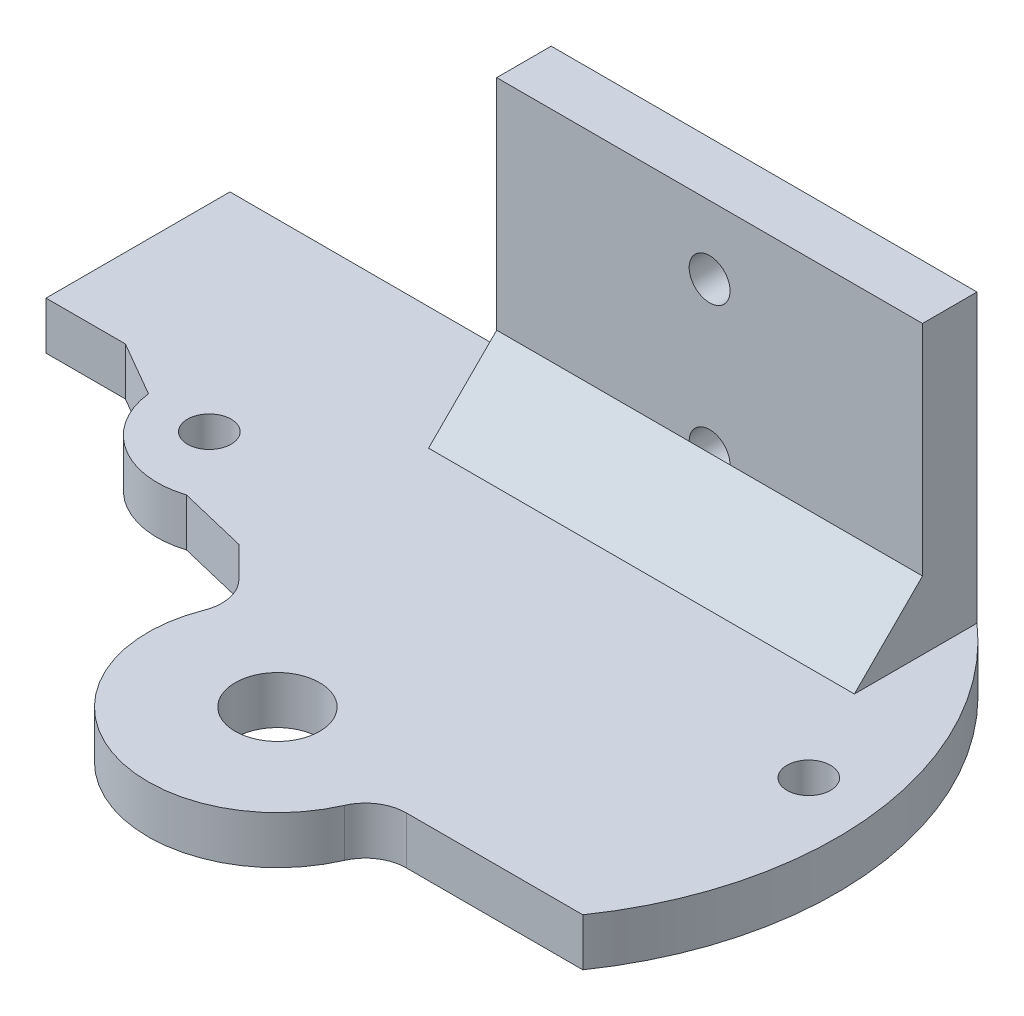
ISO-10303-21;
HEADER;
FILE_DESCRIPTION(('STEP AP214'),'2;1');
FILE_NAME('part.step','',(''),(''),'','','');
FILE_SCHEMA(('AUTOMOTIVE_DESIGN { 1 0 10303 214 1 1 1 1 }'));
ENDSEC;
DATA;
#1=APPLICATION_CONTEXT('core data for automotive mechanical design processes');
#2=APPLICATION_PROTOCOL_DEFINITION('international standard','automotive_design',2000,#1);
#3=PRODUCT_CONTEXT('',#1,'mechanical');
#4=PRODUCT('Part','Part','',(#3));
#5=PRODUCT_RELATED_PRODUCT_CATEGORY('part','',(#4));
#6=PRODUCT_DEFINITION_FORMATION('','',#4);
#7=PRODUCT_DEFINITION_CONTEXT('part definition',#1,'design');
#8=PRODUCT_DEFINITION('design','',#6,#7);
#9=PRODUCT_DEFINITION_SHAPE('','',#8);
#10=(LENGTH_UNIT() NAMED_UNIT(*) SI_UNIT(.MILLI.,.METRE.));
#11=(NAMED_UNIT(*) PLANE_ANGLE_UNIT() SI_UNIT($,.RADIAN.));
#12=(NAMED_UNIT(*) SI_UNIT($,.STERADIAN.) SOLID_ANGLE_UNIT());
#13=UNCERTAINTY_MEASURE_WITH_UNIT(LENGTH_MEASURE(1.E-05),#10,'distance_accuracy_value','');
#14=(GEOMETRIC_REPRESENTATION_CONTEXT(3) GLOBAL_UNCERTAINTY_ASSIGNED_CONTEXT((#13)) GLOBAL_UNIT_ASSIGNED_CONTEXT((#10,
#11,#12)) REPRESENTATION_CONTEXT('',''));
#15=CARTESIAN_POINT('',(0.,0.,0.));
#16=DIRECTION('',(0.,0.,1.));
#17=DIRECTION('',(1.,0.,0.));
#18=AXIS2_PLACEMENT_3D('',#15,#16,#17);
#19=CARTESIAN_POINT('',(20.3496,17.,-13.5));
#20=DIRECTION('',(0.,0.,1.));
#21=DIRECTION('',(1.,0.,0.));
#22=AXIS2_PLACEMENT_3D('',#19,#20,#21);
#23=PLANE('',#22);
#24=CARTESIAN_POINT('',(4.72198433686638,22.,-13.5));
#25=DIRECTION('',(0.,0.,1.));
#26=DIRECTION('',(1.,0.,0.));
#27=AXIS2_PLACEMENT_3D('',#24,#25,#26);
#28=CIRCLE('',#27,1.5);
#29=CARTESIAN_POINT('',(6.22198433686639,22.,-13.5));
#30=VERTEX_POINT('',#29);
#31=EDGE_CURVE('E336',#30,#30,#28,.T.);
#32=ORIENTED_EDGE('',*,*,#31,.T.);
#33=EDGE_LOOP('',(#32));
#34=FACE_BOUND('',#33,.T.);
#35=CARTESIAN_POINT('',(4.72198433686638,33.0559630595284,-13.5));
#36=DIRECTION('',(0.,0.,1.));
#37=DIRECTION('',(1.,0.,0.));
#38=AXIS2_PLACEMENT_3D('',#35,#36,#37);
#39=CIRCLE('',#38,1.5);
#40=CARTESIAN_POINT('',(6.22198433686638,33.0559630595284,-13.5));
#41=VERTEX_POINT('',#40);
#42=EDGE_CURVE('E342',#41,#41,#39,.T.);
#43=ORIENTED_EDGE('',*,*,#42,.T.);
#44=EDGE_LOOP('',(#43));
#45=FACE_BOUND('',#44,.T.);
#46=DIRECTION('',(1.,0.,0.));
#47=VECTOR('',#46,1.);
#48=CARTESIAN_POINT('',(20.3496,17.,-13.5));
#49=LINE('',#48,#47);
#50=CARTESIAN_POINT('',(-34.4868,17.,-13.5));
#51=VERTEX_POINT('',#50);
#52=CARTESIAN_POINT('',(-10.9056313262672,17.,-13.5));
#53=VERTEX_POINT('',#52);
#54=EDGE_CURVE('E347',#51,#53,#49,.T.);
#55=ORIENTED_EDGE('',*,*,#54,.T.);
#56=DIRECTION('',(0.,1.,0.));
#57=VECTOR('',#56,1.);
#58=CARTESIAN_POINT('',(-10.9056313262672,17.,-13.5));
#59=LINE('',#58,#57);
#60=CARTESIAN_POINT('',(-10.9056313262672,38.0559630595284,-13.5));
#61=VERTEX_POINT('',#60);
#62=EDGE_CURVE('E315',#53,#61,#59,.T.);
#63=ORIENTED_EDGE('',*,*,#62,.T.);
#64=DIRECTION('',(1.,0.,0.));
#65=VECTOR('',#64,1.);
#66=CARTESIAN_POINT('',(-34.4868,38.0559630595284,-13.5));
#67=LINE('',#66,#65);
#68=CARTESIAN_POINT('',(20.3496,38.0559630595284,-13.5));
#69=VERTEX_POINT('',#68);
#70=EDGE_CURVE('E283',#61,#69,#67,.T.);
#71=ORIENTED_EDGE('',*,*,#70,.T.);
#72=DIRECTION('',(0.,-1.,0.));
#73=VECTOR('',#72,1.);
#74=CARTESIAN_POINT('',(20.3496,38.0559630595284,-13.5));
#75=LINE('',#74,#73);
#76=CARTESIAN_POINT('',(20.3496,17.,-13.5));
#77=VERTEX_POINT('',#76);
#78=EDGE_CURVE('E354',#69,#77,#75,.T.);
#79=ORIENTED_EDGE('',*,*,#78,.T.);
#80=DIRECTION('',(0.,-1.,0.));
#81=VECTOR('',#80,1.);
#82=CARTESIAN_POINT('',(20.3496,17.,-13.5));
#83=LINE('',#82,#81);
#84=CARTESIAN_POINT('',(20.3496,13.5,-13.5));
#85=VERTEX_POINT('',#84);
#86=EDGE_CURVE('E169',#77,#85,#83,.T.);
#87=ORIENTED_EDGE('',*,*,#86,.T.);
#88=DIRECTION('',(-1.,0.,0.));
#89=VECTOR('',#88,1.);
#90=CARTESIAN_POINT('',(20.3496,13.5,-13.5));
#91=LINE('',#90,#89);
#92=CARTESIAN_POINT('',(-34.4868,13.5,-13.5));
#93=VERTEX_POINT('',#92);
#94=EDGE_CURVE('E170',#85,#93,#91,.T.);
#95=ORIENTED_EDGE('',*,*,#94,.T.);
#96=DIRECTION('',(0.,-1.,0.));
#97=VECTOR('',#96,1.);
#98=CARTESIAN_POINT('',(-34.4868,17.,-13.5));
#99=LINE('',#98,#97);
#100=EDGE_CURVE('E12',#51,#93,#99,.T.);
#101=ORIENTED_EDGE('',*,*,#100,.F.);
#102=EDGE_LOOP('',(#55,#63,#71,#79,#87,#95,#101));
#103=FACE_BOUND('',#102,.T.);
#104=ADVANCED_FACE('F36',(#34,#45,#103),#23,.F.);
#105=CARTESIAN_POINT('',(-34.4868,17.,-13.5));
#106=DIRECTION('',(1.,0.,0.));
#107=DIRECTION('',(0.,0.,-1.));
#108=AXIS2_PLACEMENT_3D('',#105,#106,#107);
#109=PLANE('',#108);
#110=DIRECTION('',(0.,0.,1.));
#111=VECTOR('',#110,1.);
#112=CARTESIAN_POINT('',(-34.4868,17.,-13.5));
#113=LINE('',#112,#111);
#114=CARTESIAN_POINT('',(-34.4868,17.,0.));
#115=VERTEX_POINT('',#114);
#116=EDGE_CURVE('E39',#51,#115,#113,.T.);
#117=ORIENTED_EDGE('',*,*,#116,.F.);
#118=ORIENTED_EDGE('',*,*,#100,.T.);
#119=DIRECTION('',(0.,0.,1.));
#120=VECTOR('',#119,1.);
#121=CARTESIAN_POINT('',(-34.4868,13.5,-13.5));
#122=LINE('',#121,#120);
#123=CARTESIAN_POINT('',(-34.4868,13.5,0.));
#124=VERTEX_POINT('',#123);
#125=EDGE_CURVE('E173',#93,#124,#122,.T.);
#126=ORIENTED_EDGE('',*,*,#125,.T.);
#127=DIRECTION('',(0.,-1.,0.));
#128=VECTOR('',#127,1.);
#129=CARTESIAN_POINT('',(-34.4868,17.,0.));
#130=LINE('',#129,#128);
#131=EDGE_CURVE('E45',#115,#124,#130,.T.);
#132=ORIENTED_EDGE('',*,*,#131,.F.);
#133=EDGE_LOOP('',(#117,#118,#126,#132));
#134=FACE_BOUND('',#133,.T.);
#135=ADVANCED_FACE('F383',(#134),#109,.F.);
#136=CARTESIAN_POINT('',(-34.4868,17.,0.));
#137=DIRECTION('',(0.,0.,-1.));
#138=DIRECTION('',(-1.,0.,0.));
#139=AXIS2_PLACEMENT_3D('',#136,#137,#138);
#140=PLANE('',#139);
#141=DIRECTION('',(1.,0.,0.));
#142=VECTOR('',#141,1.);
#143=CARTESIAN_POINT('',(-34.4868,13.5,0.));
#144=LINE('',#143,#142);
#145=CARTESIAN_POINT('',(-28.6613749786786,13.5,0.));
#146=VERTEX_POINT('',#145);
#147=EDGE_CURVE('E176',#124,#146,#144,.T.);
#148=ORIENTED_EDGE('',*,*,#147,.T.);
#149=DIRECTION('',(0.,-1.,0.));
#150=VECTOR('',#149,1.);
#151=CARTESIAN_POINT('',(-28.6613749786786,17.,0.));
#152=LINE('',#151,#150);
#153=CARTESIAN_POINT('',(-28.6613749786786,17.,0.));
#154=VERTEX_POINT('',#153);
#155=EDGE_CURVE('E211',#154,#146,#152,.T.);
#156=ORIENTED_EDGE('',*,*,#155,.F.);
#157=DIRECTION('',(1.,0.,0.));
#158=VECTOR('',#157,1.);
#159=CARTESIAN_POINT('',(-34.4868,17.,0.));
#160=LINE('',#159,#158);
#161=EDGE_CURVE('E242',#115,#154,#160,.T.);
#162=ORIENTED_EDGE('',*,*,#161,.F.);
#163=ORIENTED_EDGE('',*,*,#131,.T.);
#164=EDGE_LOOP('',(#148,#156,#162,#163));
#165=FACE_BOUND('',#164,.T.);
#166=ADVANCED_FACE('F388',(#165),#140,.F.);
#167=CARTESIAN_POINT('',(-28.6613749786786,17.,0.));
#168=DIRECTION('',(0.500442701800588,0.,-0.865769658866911));
#169=DIRECTION('',(-0.865769658866911,0.,-0.500442701800588));
#170=AXIS2_PLACEMENT_3D('',#167,#168,#169);
#171=PLANE('',#170);
#172=DIRECTION('',(0.865769658866911,0.,0.500442701800588));
#173=VECTOR('',#172,1.);
#174=CARTESIAN_POINT('',(-28.6613749786786,13.5,0.));
#175=LINE('',#174,#173);
#176=CARTESIAN_POINT('',(-24.6424002082218,13.5,2.32309664816397));
#177=VERTEX_POINT('',#176);
#178=EDGE_CURVE('E178',#146,#177,#175,.T.);
#179=ORIENTED_EDGE('',*,*,#178,.T.);
#180=DIRECTION('',(0.,-1.,0.));
#181=VECTOR('',#180,1.);
#182=CARTESIAN_POINT('',(-24.6424002082218,17.,2.32309664816397));
#183=LINE('',#182,#181);
#184=CARTESIAN_POINT('',(-24.6424002082218,17.,2.32309664816397));
#185=VERTEX_POINT('',#184);
#186=EDGE_CURVE('E208',#185,#177,#183,.T.);
#187=ORIENTED_EDGE('',*,*,#186,.F.);
#188=DIRECTION('',(0.865769658866911,0.,0.500442701800588));
#189=VECTOR('',#188,1.);
#190=CARTESIAN_POINT('',(-28.6613749786786,17.,0.));
#191=LINE('',#190,#189);
#192=EDGE_CURVE('E244',#154,#185,#191,.T.);
#193=ORIENTED_EDGE('',*,*,#192,.F.);
#194=ORIENTED_EDGE('',*,*,#155,.T.);
#195=EDGE_LOOP('',(#179,#187,#193,#194));
#196=FACE_BOUND('',#195,.T.);
#197=ADVANCED_FACE('F443',(#196),#171,.F.);
#198=CARTESIAN_POINT('',(-18.6805102122051,17.,1.64791691254111));
#199=DIRECTION('',(0.,-1.,0.));
#200=DIRECTION('',(0.,0.,-1.));
#201=AXIS2_PLACEMENT_3D('',#198,#199,#200);
#202=CYLINDRICAL_SURFACE('',#201,6.);
#203=CARTESIAN_POINT('',(-18.6805102122051,13.5,1.64791691254111));
#204=DIRECTION('',(0.,1.,0.));
#205=DIRECTION('',(0.,0.,1.));
#206=AXIS2_PLACEMENT_3D('',#203,#204,#205);
#207=CIRCLE('',#206,6.);
#208=CARTESIAN_POINT('',(-16.8299633080181,13.5,7.35540989592743));
#209=VERTEX_POINT('',#208);
#210=EDGE_CURVE('E180',#177,#209,#207,.T.);
#211=ORIENTED_EDGE('',*,*,#210,.T.);
#212=DIRECTION('',(0.,-1.,0.));
#213=VECTOR('',#212,1.);
#214=CARTESIAN_POINT('',(-16.8299633080181,17.,7.35540989592743));
#215=LINE('',#214,#213);
#216=CARTESIAN_POINT('',(-16.8299633080181,17.,7.35540989592743));
#217=VERTEX_POINT('',#216);
#218=EDGE_CURVE('E205',#217,#209,#215,.T.);
#219=ORIENTED_EDGE('',*,*,#218,.F.);
#220=CARTESIAN_POINT('',(-18.6805102122051,17.,1.64791691254111));
#221=DIRECTION('',(0.,1.,0.));
#222=DIRECTION('',(0.,0.,1.));
#223=AXIS2_PLACEMENT_3D('',#220,#221,#222);
#224=CIRCLE('',#223,6.);
#225=EDGE_CURVE('E246',#185,#217,#224,.T.);
#226=ORIENTED_EDGE('',*,*,#225,.F.);
#227=ORIENTED_EDGE('',*,*,#186,.T.);
#228=EDGE_LOOP('',(#211,#219,#226,#227));
#229=FACE_BOUND('',#228,.T.);
#230=ADVANCED_FACE('F439',(#229),#202,.T.);
#231=CARTESIAN_POINT('',(-16.8299633080181,17.,7.35540989592743));
#232=DIRECTION('',(0.233748216217537,0.,-0.972297162093524));
#233=DIRECTION('',(-0.972297162093524,0.,-0.233748216217537));
#234=AXIS2_PLACEMENT_3D('',#231,#232,#233);
#235=PLANE('',#234);
#236=DIRECTION('',(0.972297162093524,0.,0.233748216217537));
#237=VECTOR('',#236,1.);
#238=CARTESIAN_POINT('',(-16.8299633080181,13.5,7.35540989592743));
#239=LINE('',#238,#237);
#240=CARTESIAN_POINT('',(-11.7523069819295,13.5,8.57612014281668));
#241=VERTEX_POINT('',#240);
#242=EDGE_CURVE('E182',#209,#241,#239,.T.);
#243=ORIENTED_EDGE('',*,*,#242,.T.);
#244=DIRECTION('',(0.,-1.,0.));
#245=VECTOR('',#244,1.);
#246=CARTESIAN_POINT('',(-11.7523069819295,17.,8.57612014281668));
#247=LINE('',#246,#245);
#248=CARTESIAN_POINT('',(-11.7523069819295,17.,8.57612014281668));
#249=VERTEX_POINT('',#248);
#250=EDGE_CURVE('E202',#249,#241,#247,.T.);
#251=ORIENTED_EDGE('',*,*,#250,.F.);
#252=DIRECTION('',(0.972297162093524,0.,0.233748216217537));
#253=VECTOR('',#252,1.);
#254=CARTESIAN_POINT('',(-16.8299633080181,17.,7.35540989592743));
#255=LINE('',#254,#253);
#256=EDGE_CURVE('E248',#217,#249,#255,.T.);
#257=ORIENTED_EDGE('',*,*,#256,.F.);
#258=ORIENTED_EDGE('',*,*,#218,.T.);
#259=EDGE_LOOP('',(#243,#251,#257,#258));
#260=FACE_BOUND('',#259,.T.);
#261=ADVANCED_FACE('F436',(#260),#235,.F.);
#262=CARTESIAN_POINT('',(-11.7523069819295,17.,8.57612014281668));
#263=DIRECTION('',(0.707106781186547,0.,-0.707106781186548));
#264=DIRECTION('',(-0.707106781186548,0.,-0.707106781186547));
#265=AXIS2_PLACEMENT_3D('',#262,#263,#264);
#266=PLANE('',#265);
#267=DIRECTION('',(0.707106781186548,0.,0.707106781186547));
#268=VECTOR('',#267,1.);
#269=CARTESIAN_POINT('',(-11.7523069819295,13.5,8.57612014281668));
#270=LINE('',#269,#268);
#271=CARTESIAN_POINT('',(-9.51513943538292,13.5,10.8132876893633));
#272=VERTEX_POINT('',#271);
#273=EDGE_CURVE('E184',#241,#272,#270,.T.);
#274=ORIENTED_EDGE('',*,*,#273,.T.);
#275=DIRECTION('',(0.,-1.,0.));
#276=VECTOR('',#275,1.);
#277=CARTESIAN_POINT('',(-9.51513943538292,17.,10.8132876893633));
#278=LINE('',#277,#276);
#279=CARTESIAN_POINT('',(-9.51513943538292,17.,10.8132876893633));
#280=VERTEX_POINT('',#279);
#281=EDGE_CURVE('E199',#280,#272,#278,.T.);
#282=ORIENTED_EDGE('',*,*,#281,.F.);
#283=DIRECTION('',(0.707106781186548,0.,0.707106781186547));
#284=VECTOR('',#283,1.);
#285=CARTESIAN_POINT('',(-11.7523069819295,17.,8.57612014281668));
#286=LINE('',#285,#284);
#287=EDGE_CURVE('E250',#249,#280,#286,.T.);
#288=ORIENTED_EDGE('',*,*,#287,.F.);
#289=ORIENTED_EDGE('',*,*,#250,.T.);
#290=EDGE_LOOP('',(#274,#282,#288,#289));
#291=FACE_BOUND('',#290,.T.);
#292=ADVANCED_FACE('F256',(#291),#266,.F.);
#293=CARTESIAN_POINT('',(-11.6364597789426,17.,12.9346080329229));
#294=DIRECTION('',(0.,-1.,0.));
#295=DIRECTION('',(0.,0.,-1.));
#296=AXIS2_PLACEMENT_3D('',#293,#294,#295);
#297=CYLINDRICAL_SURFACE('',#296,3.);
#298=CARTESIAN_POINT('',(-11.6364597789426,13.5,12.9346080329229));
#299=DIRECTION('',(0.,-1.,0.));
#300=DIRECTION('',(0.,0.,1.));
#301=AXIS2_PLACEMENT_3D('',#298,#299,#300);
#302=CIRCLE('',#301,3.);
#303=CARTESIAN_POINT('',(-8.84370943199635,13.5,14.0303021050214));
#304=VERTEX_POINT('',#303);
#305=EDGE_CURVE('E186',#272,#304,#302,.T.);
#306=ORIENTED_EDGE('',*,*,#305,.T.);
#307=DIRECTION('',(0.,-1.,0.));
#308=VECTOR('',#307,1.);
#309=CARTESIAN_POINT('',(-8.84370943199635,17.,14.0303021050214));
#310=LINE('',#309,#308);
#311=CARTESIAN_POINT('',(-8.84370943199635,17.,14.0303021050214));
#312=VERTEX_POINT('',#311);
#313=EDGE_CURVE('E158',#312,#304,#310,.T.);
#314=ORIENTED_EDGE('',*,*,#313,.F.);
#315=CARTESIAN_POINT('',(-11.6364597789426,17.,12.9346080329229));
#316=DIRECTION('',(0.,-1.,0.));
#317=DIRECTION('',(0.,0.,1.));
#318=AXIS2_PLACEMENT_3D('',#315,#316,#317);
#319=CIRCLE('',#318,3.);
#320=EDGE_CURVE('E146',#280,#312,#319,.T.);
#321=ORIENTED_EDGE('',*,*,#320,.F.);
#322=ORIENTED_EDGE('',*,*,#281,.T.);
#323=EDGE_LOOP('',(#306,#314,#321,#322));
#324=FACE_BOUND('',#323,.T.);
#325=ADVANCED_FACE('F260',(#324),#297,.F.);
#326=CARTESIAN_POINT('',(0.,17.,17.5));
#327=DIRECTION('',(0.,-1.,0.));
#328=DIRECTION('',(0.,0.,-1.));
#329=AXIS2_PLACEMENT_3D('',#326,#327,#328);
#330=CYLINDRICAL_SURFACE('',#329,9.5);
#331=CARTESIAN_POINT('',(0.,13.5,17.5));
#332=DIRECTION('',(0.,1.,0.));
#333=DIRECTION('',(0.,0.,1.));
#334=AXIS2_PLACEMENT_3D('',#331,#332,#333);
#335=CIRCLE('',#334,9.5);
#336=CARTESIAN_POINT('',(8.7068938204161,13.5,21.3));
#337=VERTEX_POINT('',#336);
#338=EDGE_CURVE('E155',#304,#337,#335,.T.);
#339=ORIENTED_EDGE('',*,*,#338,.T.);
#340=DIRECTION('',(0.,-1.,0.));
#341=VECTOR('',#340,1.);
#342=CARTESIAN_POINT('',(8.7068938204161,17.,21.3));
#343=LINE('',#342,#341);
#344=CARTESIAN_POINT('',(8.7068938204161,17.,21.3));
#345=VERTEX_POINT('',#344);
#346=EDGE_CURVE('E152',#345,#337,#343,.T.);
#347=ORIENTED_EDGE('',*,*,#346,.F.);
#348=CARTESIAN_POINT('',(0.,17.,17.5));
#349=DIRECTION('',(0.,1.,0.));
#350=DIRECTION('',(0.,0.,1.));
#351=AXIS2_PLACEMENT_3D('',#348,#349,#350);
#352=CIRCLE('',#351,9.5);
#353=EDGE_CURVE('E137',#312,#345,#352,.T.);
#354=ORIENTED_EDGE('',*,*,#353,.F.);
#355=ORIENTED_EDGE('',*,*,#313,.T.);
#356=EDGE_LOOP('',(#339,#347,#354,#355));
#357=FACE_BOUND('',#356,.T.);
#358=ADVANCED_FACE('F153',(#357),#330,.T.);
#359=CARTESIAN_POINT('',(11.4564392373896,17.,22.5));
#360=DIRECTION('',(0.,-1.,0.));
#361=DIRECTION('',(0.,0.,-1.));
#362=AXIS2_PLACEMENT_3D('',#359,#360,#361);
#363=CYLINDRICAL_SURFACE('',#362,3.);
#364=CARTESIAN_POINT('',(11.4564392373896,13.5,22.5));
#365=DIRECTION('',(0.,-1.,0.));
#366=DIRECTION('',(0.,0.,1.));
#367=AXIS2_PLACEMENT_3D('',#364,#365,#366);
#368=CIRCLE('',#367,3.);
#369=CARTESIAN_POINT('',(11.4564392373896,13.5,19.5));
#370=VERTEX_POINT('',#369);
#371=EDGE_CURVE('E189',#337,#370,#368,.T.);
#372=ORIENTED_EDGE('',*,*,#371,.T.);
#373=DIRECTION('',(0.,-1.,0.));
#374=VECTOR('',#373,1.);
#375=CARTESIAN_POINT('',(11.4564392373896,17.,19.5));
#376=LINE('',#375,#374);
#377=CARTESIAN_POINT('',(11.4564392373896,17.,19.5));
#378=VERTEX_POINT('',#377);
#379=EDGE_CURVE('E159',#378,#370,#376,.T.);
#380=ORIENTED_EDGE('',*,*,#379,.F.);
#381=CARTESIAN_POINT('',(11.4564392373896,17.,22.5));
#382=DIRECTION('',(0.,-1.,0.));
#383=DIRECTION('',(0.,0.,1.));
#384=AXIS2_PLACEMENT_3D('',#381,#382,#383);
#385=CIRCLE('',#384,3.);
#386=EDGE_CURVE('E143',#345,#378,#385,.T.);
#387=ORIENTED_EDGE('',*,*,#386,.F.);
#388=ORIENTED_EDGE('',*,*,#346,.T.);
#389=EDGE_LOOP('',(#372,#380,#387,#388));
#390=FACE_BOUND('',#389,.T.);
#391=ADVANCED_FACE('F161',(#390),#363,.F.);
#392=CARTESIAN_POINT('',(11.4564392373896,17.,19.5));
#393=DIRECTION('',(0.,0.,-1.));
#394=DIRECTION('',(-1.,0.,0.));
#395=AXIS2_PLACEMENT_3D('',#392,#393,#394);
#396=PLANE('',#395);
#397=DIRECTION('',(1.,0.,0.));
#398=VECTOR('',#397,1.);
#399=CARTESIAN_POINT('',(11.4564392373896,13.5,19.5));
#400=LINE('',#399,#398);
#401=CARTESIAN_POINT('',(24.4182308941496,13.5,19.5));
#402=VERTEX_POINT('',#401);
#403=EDGE_CURVE('E191',#370,#402,#400,.T.);
#404=ORIENTED_EDGE('',*,*,#403,.T.);
#405=DIRECTION('',(0.,-1.,0.));
#406=VECTOR('',#405,1.);
#407=CARTESIAN_POINT('',(24.4182308941496,17.,19.5));
#408=LINE('',#407,#406);
#409=CARTESIAN_POINT('',(24.4182308941496,17.,19.5));
#410=VERTEX_POINT('',#409);
#411=EDGE_CURVE('E195',#410,#402,#408,.T.);
#412=ORIENTED_EDGE('',*,*,#411,.F.);
#413=DIRECTION('',(1.,0.,0.));
#414=VECTOR('',#413,1.);
#415=CARTESIAN_POINT('',(11.4564392373896,17.,19.5));
#416=LINE('',#415,#414);
#417=EDGE_CURVE('E62',#378,#410,#416,.T.);
#418=ORIENTED_EDGE('',*,*,#417,.F.);
#419=ORIENTED_EDGE('',*,*,#379,.T.);
#420=EDGE_LOOP('',(#404,#412,#418,#419));
#421=FACE_BOUND('',#420,.T.);
#422=ADVANCED_FACE('F266',(#421),#396,.F.);
#423=CARTESIAN_POINT('',(3.8530842496332,17.,5.28470037285398));
#424=DIRECTION('',(0.,-1.,0.));
#425=DIRECTION('',(0.,0.,-1.));
#426=AXIS2_PLACEMENT_3D('',#423,#424,#425);
#427=CYLINDRICAL_SURFACE('',#426,25.);
#428=CARTESIAN_POINT('',(3.8530842496332,13.5,5.28470037285398));
#429=DIRECTION('',(0.,1.,0.));
#430=DIRECTION('',(0.,0.,1.));
#431=AXIS2_PLACEMENT_3D('',#428,#429,#430);
#432=CIRCLE('',#431,25.);
#433=EDGE_CURVE('E107',#402,#85,#432,.T.);
#434=ORIENTED_EDGE('',*,*,#433,.T.);
#435=ORIENTED_EDGE('',*,*,#86,.F.);
#436=CARTESIAN_POINT('',(3.8530842496332,17.,5.28470037285398));
#437=DIRECTION('',(0.,1.,0.));
#438=DIRECTION('',(0.,0.,1.));
#439=AXIS2_PLACEMENT_3D('',#436,#437,#438);
#440=CIRCLE('',#439,25.);
#441=EDGE_CURVE('E164',#410,#77,#440,.T.);
#442=ORIENTED_EDGE('',*,*,#441,.F.);
#443=ORIENTED_EDGE('',*,*,#411,.T.);
#444=EDGE_LOOP('',(#434,#435,#442,#443));
#445=FACE_BOUND('',#444,.T.);
#446=ADVANCED_FACE('F268',(#445),#427,.T.);
#447=CARTESIAN_POINT('',(-18.6805102122051,17.,1.64791691254111));
#448=DIRECTION('',(0.,1.,0.));
#449=DIRECTION('',(0.,0.,1.));
#450=AXIS2_PLACEMENT_3D('',#447,#448,#449);
#451=PLANE('',#450);
#452=DIRECTION('',(0.,0.,-1.));
#453=VECTOR('',#452,1.);
#454=CARTESIAN_POINT('',(20.3496,17.,-9.49999999999999));
#455=LINE('',#454,#453);
#456=CARTESIAN_POINT('',(20.3496,17.,-4.49999999999999));
#457=VERTEX_POINT('',#456);
#458=EDGE_CURVE('E230',#457,#77,#455,.T.);
#459=ORIENTED_EDGE('',*,*,#458,.F.);
#460=DIRECTION('',(-1.,0.,0.));
#461=VECTOR('',#460,1.);
#462=CARTESIAN_POINT('',(27.4206678118655,17.,-4.49999999999999));
#463=LINE('',#462,#461);
#464=CARTESIAN_POINT('',(-10.9056313262672,17.,-4.49999999999999));
#465=VERTEX_POINT('',#464);
#466=EDGE_CURVE('E322',#457,#465,#463,.T.);
#467=ORIENTED_EDGE('',*,*,#466,.T.);
#468=DIRECTION('',(0.,0.,1.));
#469=VECTOR('',#468,1.);
#470=CARTESIAN_POINT('',(-10.9056313262672,17.,-19.5));
#471=LINE('',#470,#469);
#472=EDGE_CURVE('E310',#53,#465,#471,.T.);
#473=ORIENTED_EDGE('',*,*,#472,.F.);
#474=ORIENTED_EDGE('',*,*,#54,.F.);
#475=ORIENTED_EDGE('',*,*,#116,.T.);
#476=ORIENTED_EDGE('',*,*,#161,.T.);
#477=ORIENTED_EDGE('',*,*,#192,.T.);
#478=ORIENTED_EDGE('',*,*,#225,.T.);
#479=ORIENTED_EDGE('',*,*,#256,.T.);
#480=ORIENTED_EDGE('',*,*,#287,.T.);
#481=ORIENTED_EDGE('',*,*,#320,.T.);
#482=ORIENTED_EDGE('',*,*,#353,.T.);
#483=ORIENTED_EDGE('',*,*,#386,.T.);
#484=ORIENTED_EDGE('',*,*,#417,.T.);
#485=ORIENTED_EDGE('',*,*,#441,.T.);
#486=EDGE_LOOP('',(#459,#467,#473,#474,#475,#476,#477,#478,#479,#480,#481,#482,#483,#484,#485));
#487=FACE_BOUND('',#486,.T.);
#488=CARTESIAN_POINT('',(0.,17.,17.5));
#489=DIRECTION('',(0.,1.,0.));
#490=DIRECTION('',(0.,0.,1.));
#491=AXIS2_PLACEMENT_3D('',#488,#489,#490);
#492=CIRCLE('',#491,3.1);
#493=CARTESIAN_POINT('',(0.,17.,20.6));
#494=VERTEX_POINT('',#493);
#495=EDGE_CURVE('E224',#494,#494,#492,.T.);
#496=ORIENTED_EDGE('',*,*,#495,.F.);
#497=EDGE_LOOP('',(#496));
#498=FACE_BOUND('',#497,.T.);
#499=CARTESIAN_POINT('',(-20.,17.,2.50000000000001));
#500=DIRECTION('',(0.,1.,0.));
#501=DIRECTION('',(0.,0.,1.));
#502=AXIS2_PLACEMENT_3D('',#499,#500,#501);
#503=CIRCLE('',#502,1.6);
#504=CARTESIAN_POINT('',(-20.,17.,4.10000000000001));
#505=VERTEX_POINT('',#504);
#506=EDGE_CURVE('E219',#505,#505,#503,.T.);
#507=ORIENTED_EDGE('',*,*,#506,.F.);
#508=EDGE_LOOP('',(#507));
#509=FACE_BOUND('',#508,.T.);
#510=CARTESIAN_POINT('',(24.,17.,2.50000000000001));
#511=DIRECTION('',(0.,1.,0.));
#512=DIRECTION('',(0.,0.,1.));
#513=AXIS2_PLACEMENT_3D('',#510,#511,#512);
#514=CIRCLE('',#513,1.6);
#515=CARTESIAN_POINT('',(24.,17.,4.10000000000001));
#516=VERTEX_POINT('',#515);
#517=EDGE_CURVE('E223',#516,#516,#514,.T.);
#518=ORIENTED_EDGE('',*,*,#517,.F.);
#519=EDGE_LOOP('',(#518));
#520=FACE_BOUND('',#519,.T.);
#521=ADVANCED_FACE('F140',(#487,#498,#509,#520),#451,.T.);
#522=CARTESIAN_POINT('',(-18.6805102122051,13.5,1.64791691254111));
#523=DIRECTION('',(0.,1.,0.));
#524=DIRECTION('',(0.,0.,1.));
#525=AXIS2_PLACEMENT_3D('',#522,#523,#524);
#526=PLANE('',#525);
#527=CARTESIAN_POINT('',(0.,13.5,17.5));
#528=DIRECTION('',(0.,1.,0.));
#529=DIRECTION('',(0.,0.,1.));
#530=AXIS2_PLACEMENT_3D('',#527,#528,#529);
#531=CIRCLE('',#530,3.1);
#532=CARTESIAN_POINT('',(0.,13.5,20.6));
#533=VERTEX_POINT('',#532);
#534=EDGE_CURVE('E221',#533,#533,#531,.T.);
#535=ORIENTED_EDGE('',*,*,#534,.T.);
#536=EDGE_LOOP('',(#535));
#537=FACE_BOUND('',#536,.T.);
#538=CARTESIAN_POINT('',(-20.,13.5,2.50000000000001));
#539=DIRECTION('',(0.,1.,0.));
#540=DIRECTION('',(0.,0.,1.));
#541=AXIS2_PLACEMENT_3D('',#538,#539,#540);
#542=CIRCLE('',#541,1.6);
#543=CARTESIAN_POINT('',(-20.,13.5,4.10000000000001));
#544=VERTEX_POINT('',#543);
#545=EDGE_CURVE('E174',#544,#544,#542,.T.);
#546=ORIENTED_EDGE('',*,*,#545,.T.);
#547=EDGE_LOOP('',(#546));
#548=FACE_BOUND('',#547,.T.);
#549=CARTESIAN_POINT('',(24.,13.5,2.50000000000001));
#550=DIRECTION('',(0.,1.,0.));
#551=DIRECTION('',(0.,0.,1.));
#552=AXIS2_PLACEMENT_3D('',#549,#550,#551);
#553=CIRCLE('',#552,1.6);
#554=CARTESIAN_POINT('',(24.,13.5,4.10000000000001));
#555=VERTEX_POINT('',#554);
#556=EDGE_CURVE('E216',#555,#555,#553,.T.);
#557=ORIENTED_EDGE('',*,*,#556,.T.);
#558=EDGE_LOOP('',(#557));
#559=FACE_BOUND('',#558,.T.);
#560=ORIENTED_EDGE('',*,*,#94,.F.);
#561=ORIENTED_EDGE('',*,*,#433,.F.);
#562=ORIENTED_EDGE('',*,*,#403,.F.);
#563=ORIENTED_EDGE('',*,*,#371,.F.);
#564=ORIENTED_EDGE('',*,*,#338,.F.);
#565=ORIENTED_EDGE('',*,*,#305,.F.);
#566=ORIENTED_EDGE('',*,*,#273,.F.);
#567=ORIENTED_EDGE('',*,*,#242,.F.);
#568=ORIENTED_EDGE('',*,*,#210,.F.);
#569=ORIENTED_EDGE('',*,*,#178,.F.);
#570=ORIENTED_EDGE('',*,*,#147,.F.);
#571=ORIENTED_EDGE('',*,*,#125,.F.);
#572=EDGE_LOOP('',(#560,#561,#562,#563,#564,#565,#566,#567,#568,#569,#570,#571));
#573=FACE_BOUND('',#572,.T.);
#574=ADVANCED_FACE('F263',(#537,#548,#559,#573),#526,.F.);
#575=CARTESIAN_POINT('',(24.,0.,2.50000000000001));
#576=DIRECTION('',(0.,1.,0.));
#577=DIRECTION('',(0.,0.,1.));
#578=AXIS2_PLACEMENT_3D('',#575,#576,#577);
#579=CYLINDRICAL_SURFACE('',#578,1.6);
#580=ORIENTED_EDGE('',*,*,#517,.T.);
#581=EDGE_LOOP('',(#580));
#582=FACE_BOUND('',#581,.T.);
#583=ORIENTED_EDGE('',*,*,#556,.F.);
#584=EDGE_LOOP('',(#583));
#585=FACE_BOUND('',#584,.T.);
#586=ADVANCED_FACE('F415',(#582,#585),#579,.F.);
#587=CARTESIAN_POINT('',(-20.,0.,2.50000000000001));
#588=DIRECTION('',(0.,1.,0.));
#589=DIRECTION('',(0.,0.,1.));
#590=AXIS2_PLACEMENT_3D('',#587,#588,#589);
#591=CYLINDRICAL_SURFACE('',#590,1.6);
#592=ORIENTED_EDGE('',*,*,#506,.T.);
#593=EDGE_LOOP('',(#592));
#594=FACE_BOUND('',#593,.T.);
#595=ORIENTED_EDGE('',*,*,#545,.F.);
#596=EDGE_LOOP('',(#595));
#597=FACE_BOUND('',#596,.T.);
#598=ADVANCED_FACE('F412',(#594,#597),#591,.F.);
#599=CARTESIAN_POINT('',(0.,12.,17.5));
#600=DIRECTION('',(0.,1.,0.));
#601=DIRECTION('',(0.,0.,1.));
#602=AXIS2_PLACEMENT_3D('',#599,#600,#601);
#603=CYLINDRICAL_SURFACE('',#602,3.1);
#604=ORIENTED_EDGE('',*,*,#495,.T.);
#605=EDGE_LOOP('',(#604));
#606=FACE_BOUND('',#605,.T.);
#607=ORIENTED_EDGE('',*,*,#534,.F.);
#608=EDGE_LOOP('',(#607));
#609=FACE_BOUND('',#608,.T.);
#610=ADVANCED_FACE('F407',(#606,#609),#603,.F.);
#611=CARTESIAN_POINT('',(20.3496,38.0559630595284,-9.49999999999999));
#612=DIRECTION('',(1.,0.,0.));
#613=DIRECTION('',(0.,1.,0.));
#614=AXIS2_PLACEMENT_3D('',#611,#612,#613);
#615=PLANE('',#614);
#616=ORIENTED_EDGE('',*,*,#78,.F.);
#617=DIRECTION('',(0.,0.,-1.));
#618=VECTOR('',#617,1.);
#619=CARTESIAN_POINT('',(20.3496,38.0559630595284,-9.49999999999999));
#620=LINE('',#619,#618);
#621=CARTESIAN_POINT('',(20.3496,38.0559630595284,-9.49999999999999));
#622=VERTEX_POINT('',#621);
#623=EDGE_CURVE('E235',#622,#69,#620,.T.);
#624=ORIENTED_EDGE('',*,*,#623,.F.);
#625=DIRECTION('',(0.,-1.,0.));
#626=VECTOR('',#625,1.);
#627=CARTESIAN_POINT('',(20.3496,38.0559630595284,-9.49999999999999));
#628=LINE('',#627,#626);
#629=CARTESIAN_POINT('',(20.3496,22.,-9.49999999999999));
#630=VERTEX_POINT('',#629);
#631=EDGE_CURVE('E353',#622,#630,#628,.T.);
#632=ORIENTED_EDGE('',*,*,#631,.T.);
#633=DIRECTION('',(0.,0.707106781186547,-0.707106781186548));
#634=VECTOR('',#633,1.);
#635=CARTESIAN_POINT('',(20.3496,17.,-4.49999999999999));
#636=LINE('',#635,#634);
#637=EDGE_CURVE('E326',#457,#630,#636,.T.);
#638=ORIENTED_EDGE('',*,*,#637,.F.);
#639=ORIENTED_EDGE('',*,*,#458,.T.);
#640=EDGE_LOOP('',(#616,#624,#632,#638,#639));
#641=FACE_BOUND('',#640,.T.);
#642=ADVANCED_FACE('F359',(#641),#615,.T.);
#643=CARTESIAN_POINT('',(-34.4868,38.0559630595284,-9.49999999999999));
#644=DIRECTION('',(0.,1.,0.));
#645=DIRECTION('',(0.,0.,1.));
#646=AXIS2_PLACEMENT_3D('',#643,#644,#645);
#647=PLANE('',#646);
#648=DIRECTION('',(0.,0.,1.));
#649=VECTOR('',#648,1.);
#650=CARTESIAN_POINT('',(-10.9056313262672,38.0559630595284,-19.5));
#651=LINE('',#650,#649);
#652=CARTESIAN_POINT('',(-10.9056313262672,38.0559630595284,-9.49999999999999));
#653=VERTEX_POINT('',#652);
#654=EDGE_CURVE('E317',#61,#653,#651,.T.);
#655=ORIENTED_EDGE('',*,*,#654,.T.);
#656=DIRECTION('',(1.,0.,0.));
#657=VECTOR('',#656,1.);
#658=CARTESIAN_POINT('',(-34.4868,38.0559630595284,-9.49999999999999));
#659=LINE('',#658,#657);
#660=EDGE_CURVE('E351',#653,#622,#659,.T.);
#661=ORIENTED_EDGE('',*,*,#660,.T.);
#662=ORIENTED_EDGE('',*,*,#623,.T.);
#663=ORIENTED_EDGE('',*,*,#70,.F.);
#664=EDGE_LOOP('',(#655,#661,#662,#663));
#665=FACE_BOUND('',#664,.T.);
#666=ADVANCED_FACE('F404',(#665),#647,.T.);
#667=CARTESIAN_POINT('',(0.,0.,-9.49999999999999));
#668=DIRECTION('',(0.,0.,-1.));
#669=DIRECTION('',(-1.,0.,0.));
#670=AXIS2_PLACEMENT_3D('',#667,#668,#669);
#671=PLANE('',#670);
#672=DIRECTION('',(0.,1.,0.));
#673=VECTOR('',#672,1.);
#674=CARTESIAN_POINT('',(-10.9056313262672,38.0559630595284,-9.49999999999999));
#675=LINE('',#674,#673);
#676=CARTESIAN_POINT('',(-10.9056313262672,22.,-9.49999999999999));
#677=VERTEX_POINT('',#676);
#678=EDGE_CURVE('E318',#677,#653,#675,.T.);
#679=ORIENTED_EDGE('',*,*,#678,.F.);
#680=DIRECTION('',(-1.,0.,0.));
#681=VECTOR('',#680,1.);
#682=CARTESIAN_POINT('',(27.4206678118655,22.,-9.49999999999999));
#683=LINE('',#682,#681);
#684=CARTESIAN_POINT('',(3.22198433686638,22.,-9.49999999999999));
#685=VERTEX_POINT('',#684);
#686=EDGE_CURVE('E324',#685,#677,#683,.T.);
#687=ORIENTED_EDGE('',*,*,#686,.F.);
#688=CARTESIAN_POINT('',(4.72198433686638,22.,-9.49999999999999));
#689=DIRECTION('',(0.,0.,1.));
#690=DIRECTION('',(1.,0.,0.));
#691=AXIS2_PLACEMENT_3D('',#688,#689,#690);
#692=CIRCLE('',#691,1.5);
#693=CARTESIAN_POINT('',(6.22198433686639,22.,-9.49999999999999));
#694=VERTEX_POINT('',#693);
#695=EDGE_CURVE('E333',#694,#685,#692,.T.);
#696=ORIENTED_EDGE('',*,*,#695,.F.);
#697=EDGE_CURVE('E53',#630,#694,#683,.T.);
#698=ORIENTED_EDGE('',*,*,#697,.F.);
#699=ORIENTED_EDGE('',*,*,#631,.F.);
#700=ORIENTED_EDGE('',*,*,#660,.F.);
#701=EDGE_LOOP('',(#679,#687,#696,#698,#699,#700));
#702=FACE_BOUND('',#701,.T.);
#703=CARTESIAN_POINT('',(4.72198433686638,33.0559630595284,-9.49999999999999));
#704=DIRECTION('',(0.,0.,1.));
#705=DIRECTION('',(1.,0.,0.));
#706=AXIS2_PLACEMENT_3D('',#703,#704,#705);
#707=CIRCLE('',#706,1.5);
#708=CARTESIAN_POINT('',(6.22198433686638,33.0559630595284,-9.49999999999999));
#709=VERTEX_POINT('',#708);
#710=EDGE_CURVE('E339',#709,#709,#707,.T.);
#711=ORIENTED_EDGE('',*,*,#710,.F.);
#712=EDGE_LOOP('',(#711));
#713=FACE_BOUND('',#712,.T.);
#714=ADVANCED_FACE('F364',(#702,#713),#671,.F.);
#715=CARTESIAN_POINT('',(-10.9056313262672,38.0559630595284,-19.5));
#716=DIRECTION('',(1.,0.,0.));
#717=DIRECTION('',(0.,0.,-1.));
#718=AXIS2_PLACEMENT_3D('',#715,#716,#717);
#719=PLANE('',#718);
#720=ORIENTED_EDGE('',*,*,#472,.T.);
#721=DIRECTION('',(0.,0.707106781186547,-0.707106781186548));
#722=VECTOR('',#721,1.);
#723=CARTESIAN_POINT('',(-10.9056313262672,17.,-4.49999999999999));
#724=LINE('',#723,#722);
#725=EDGE_CURVE('E313',#465,#677,#724,.T.);
#726=ORIENTED_EDGE('',*,*,#725,.T.);
#727=ORIENTED_EDGE('',*,*,#678,.T.);
#728=ORIENTED_EDGE('',*,*,#654,.F.);
#729=ORIENTED_EDGE('',*,*,#62,.F.);
#730=EDGE_LOOP('',(#720,#726,#727,#728,#729));
#731=FACE_BOUND('',#730,.T.);
#732=ADVANCED_FACE('F312',(#731),#719,.F.);
#733=CARTESIAN_POINT('',(4.72198433686638,33.0559630595284,-19.5));
#734=DIRECTION('',(0.,0.,1.));
#735=DIRECTION('',(1.,0.,0.));
#736=AXIS2_PLACEMENT_3D('',#733,#734,#735);
#737=CYLINDRICAL_SURFACE('',#736,1.5);
#738=ORIENTED_EDGE('',*,*,#710,.T.);
#739=EDGE_LOOP('',(#738));
#740=FACE_BOUND('',#739,.T.);
#741=ORIENTED_EDGE('',*,*,#42,.F.);
#742=EDGE_LOOP('',(#741));
#743=FACE_BOUND('',#742,.T.);
#744=ADVANCED_FACE('F380',(#740,#743),#737,.F.);
#745=CARTESIAN_POINT('',(4.72198433686638,22.,-19.5));
#746=DIRECTION('',(0.,0.,1.));
#747=DIRECTION('',(1.,0.,0.));
#748=AXIS2_PLACEMENT_3D('',#745,#746,#747);
#749=CYLINDRICAL_SURFACE('',#748,1.5);
#750=ORIENTED_EDGE('',*,*,#695,.T.);
#751=EDGE_CURVE('E331',#685,#694,#692,.T.);
#752=ORIENTED_EDGE('',*,*,#751,.T.);
#753=EDGE_LOOP('',(#750,#752));
#754=FACE_BOUND('',#753,.T.);
#755=ORIENTED_EDGE('',*,*,#31,.F.);
#756=EDGE_LOOP('',(#755));
#757=FACE_BOUND('',#756,.T.);
#758=ADVANCED_FACE('F369',(#754,#757),#749,.F.);
#759=CARTESIAN_POINT('',(27.4206678118655,22.,-9.49999999999999));
#760=DIRECTION('',(0.,0.,-1.));
#761=DIRECTION('',(-1.,0.,0.));
#762=AXIS2_PLACEMENT_3D('',#759,#760,#761);
#763=PLANE('',#762);
#764=ORIENTED_EDGE('',*,*,#751,.F.);
#765=EDGE_CURVE('E332',#694,#685,#683,.T.);
#766=ORIENTED_EDGE('',*,*,#765,.F.);
#767=EDGE_LOOP('',(#764,#766));
#768=FACE_BOUND('',#767,.T.);
#769=ADVANCED_FACE('F372',(#768),#763,.T.);
#770=CARTESIAN_POINT('',(27.4206678118655,17.,-4.49999999999999));
#771=DIRECTION('',(0.,0.707106781186548,0.707106781186547));
#772=DIRECTION('',(0.,-0.707106781186547,0.707106781186548));
#773=AXIS2_PLACEMENT_3D('',#770,#771,#772);
#774=PLANE('',#773);
#775=ORIENTED_EDGE('',*,*,#466,.F.);
#776=ORIENTED_EDGE('',*,*,#637,.T.);
#777=ORIENTED_EDGE('',*,*,#697,.T.);
#778=ORIENTED_EDGE('',*,*,#765,.T.);
#779=ORIENTED_EDGE('',*,*,#686,.T.);
#780=ORIENTED_EDGE('',*,*,#725,.F.);
#781=EDGE_LOOP('',(#775,#776,#777,#778,#779,#780));
#782=FACE_BOUND('',#781,.T.);
#783=ADVANCED_FACE('F321',(#782),#774,.T.);
#784=CLOSED_SHELL('',(#104,#135,#166,#197,#230,#261,#292,#325,#358,#391,#422,#446,#521,#574,
#586,#598,#610,#642,#666,#714,#732,#744,#758,#769,#783));
#785=MANIFOLD_SOLID_BREP('B2',#784);
#786=ADVANCED_BREP_SHAPE_REPRESENTATION('',(#18,#785),#14);
#787=SHAPE_DEFINITION_REPRESENTATION(#9,#786);
ENDSEC;
END-ISO-10303-21;
